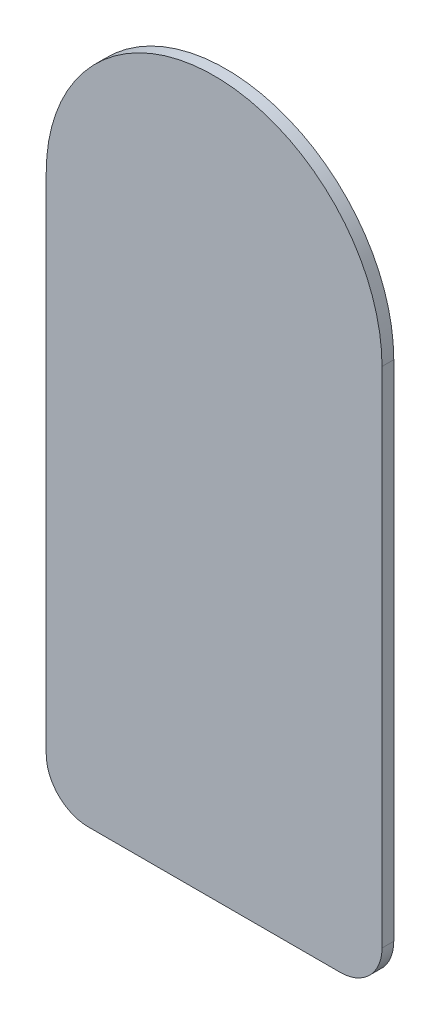
ISO-10303-21;
HEADER;
FILE_DESCRIPTION(('STEP AP214'),'2;1');
FILE_NAME('part.step','',(''),(''),'','','');
FILE_SCHEMA(('AUTOMOTIVE_DESIGN { 1 0 10303 214 1 1 1 1 }'));
ENDSEC;
DATA;
#1=APPLICATION_CONTEXT('core data for automotive mechanical design processes');
#2=APPLICATION_PROTOCOL_DEFINITION('international standard','automotive_design',2000,#1);
#3=PRODUCT_CONTEXT('',#1,'mechanical');
#4=PRODUCT('Part','Part','',(#3));
#5=PRODUCT_RELATED_PRODUCT_CATEGORY('part','',(#4));
#6=PRODUCT_DEFINITION_FORMATION('','',#4);
#7=PRODUCT_DEFINITION_CONTEXT('part definition',#1,'design');
#8=PRODUCT_DEFINITION('design','',#6,#7);
#9=PRODUCT_DEFINITION_SHAPE('','',#8);
#10=(LENGTH_UNIT() NAMED_UNIT(*) SI_UNIT(.MILLI.,.METRE.));
#11=(NAMED_UNIT(*) PLANE_ANGLE_UNIT() SI_UNIT($,.RADIAN.));
#12=(NAMED_UNIT(*) SI_UNIT($,.STERADIAN.) SOLID_ANGLE_UNIT());
#13=UNCERTAINTY_MEASURE_WITH_UNIT(LENGTH_MEASURE(1.E-05),#10,'distance_accuracy_value','');
#14=(GEOMETRIC_REPRESENTATION_CONTEXT(3) GLOBAL_UNCERTAINTY_ASSIGNED_CONTEXT((#13)) GLOBAL_UNIT_ASSIGNED_CONTEXT((#10,
#11,#12)) REPRESENTATION_CONTEXT('',''));
#15=CARTESIAN_POINT('',(0.,0.,0.));
#16=DIRECTION('',(0.,0.,1.));
#17=DIRECTION('',(1.,0.,0.));
#18=AXIS2_PLACEMENT_3D('',#15,#16,#17);
#19=CARTESIAN_POINT('',(0.,0.,0.7112));
#20=DIRECTION('',(0.,0.,-1.));
#21=DIRECTION('',(-1.,0.,0.));
#22=AXIS2_PLACEMENT_3D('',#19,#20,#21);
#23=CYLINDRICAL_SURFACE('',#22,10.16);
#24=CARTESIAN_POINT('',(0.,0.,0.));
#25=DIRECTION('',(0.,0.,1.));
#26=DIRECTION('',(1.,0.,0.));
#27=AXIS2_PLACEMENT_3D('',#24,#25,#26);
#28=CIRCLE('',#27,10.16);
#29=CARTESIAN_POINT('',(10.16,2.47198095326695E-13,0.));
#30=VERTEX_POINT('',#29);
#31=CARTESIAN_POINT('',(-10.16,-2.45463371850718E-13,0.));
#32=VERTEX_POINT('',#31);
#33=EDGE_CURVE('E117',#30,#32,#28,.T.);
#34=ORIENTED_EDGE('',*,*,#33,.T.);
#35=DIRECTION('',(0.,0.,-1.));
#36=VECTOR('',#35,1.);
#37=CARTESIAN_POINT('',(-10.16,-2.45463371850718E-13,0.7112));
#38=LINE('',#37,#36);
#39=CARTESIAN_POINT('',(-10.16,-2.45463371850718E-13,0.7112));
#40=VERTEX_POINT('',#39);
#41=EDGE_CURVE('E11',#40,#32,#38,.T.);
#42=ORIENTED_EDGE('',*,*,#41,.F.);
#43=CARTESIAN_POINT('',(0.,0.,0.7112));
#44=DIRECTION('',(0.,0.,1.));
#45=DIRECTION('',(1.,0.,0.));
#46=AXIS2_PLACEMENT_3D('',#43,#44,#45);
#47=CIRCLE('',#46,10.16);
#48=CARTESIAN_POINT('',(10.16,2.47198095326695E-13,0.7112));
#49=VERTEX_POINT('',#48);
#50=EDGE_CURVE('E127',#49,#40,#47,.T.);
#51=ORIENTED_EDGE('',*,*,#50,.F.);
#52=DIRECTION('',(0.,0.,-1.));
#53=VECTOR('',#52,1.);
#54=CARTESIAN_POINT('',(10.16,2.47198095326695E-13,0.7112));
#55=LINE('',#54,#53);
#56=EDGE_CURVE('E113',#49,#30,#55,.T.);
#57=ORIENTED_EDGE('',*,*,#56,.T.);
#58=EDGE_LOOP('',(#34,#42,#51,#57));
#59=FACE_BOUND('',#58,.T.);
#60=ADVANCED_FACE('F33',(#59),#23,.T.);
#61=CARTESIAN_POINT('',(-10.16,-2.45463371850718E-13,0.7112));
#62=DIRECTION('',(1.,0.,0.));
#63=DIRECTION('',(0.,1.,0.));
#64=AXIS2_PLACEMENT_3D('',#61,#62,#63);
#65=PLANE('',#64);
#66=DIRECTION('',(0.,-1.,0.));
#67=VECTOR('',#66,1.);
#68=CARTESIAN_POINT('',(-10.16,-2.45463371850718E-13,0.));
#69=LINE('',#68,#67);
#70=CARTESIAN_POINT('',(-10.1599999999993,-30.4800000000002,0.));
#71=VERTEX_POINT('',#70);
#72=EDGE_CURVE('E120',#32,#71,#69,.T.);
#73=ORIENTED_EDGE('',*,*,#72,.T.);
#74=DIRECTION('',(0.,0.,-1.));
#75=VECTOR('',#74,1.);
#76=CARTESIAN_POINT('',(-10.1599999999993,-30.4800000000002,0.7112));
#77=LINE('',#76,#75);
#78=CARTESIAN_POINT('',(-10.1599999999993,-30.4800000000002,0.7112));
#79=VERTEX_POINT('',#78);
#80=EDGE_CURVE('E41',#79,#71,#77,.T.);
#81=ORIENTED_EDGE('',*,*,#80,.F.);
#82=DIRECTION('',(0.,-1.,0.));
#83=VECTOR('',#82,1.);
#84=CARTESIAN_POINT('',(-10.16,-2.45463371850718E-13,0.7112));
#85=LINE('',#84,#83);
#86=EDGE_CURVE('E86',#40,#79,#85,.T.);
#87=ORIENTED_EDGE('',*,*,#86,.F.);
#88=ORIENTED_EDGE('',*,*,#41,.T.);
#89=EDGE_LOOP('',(#73,#81,#87,#88));
#90=FACE_BOUND('',#89,.T.);
#91=ADVANCED_FACE('F151',(#90),#65,.F.);
#92=CARTESIAN_POINT('',(-7.61999999999926,-30.4800000000002,0.7112));
#93=DIRECTION('',(0.,0.,-1.));
#94=DIRECTION('',(-1.,0.,0.));
#95=AXIS2_PLACEMENT_3D('',#92,#93,#94);
#96=CYLINDRICAL_SURFACE('',#95,2.54);
#97=CARTESIAN_POINT('',(-7.61999999999926,-30.4800000000002,0.));
#98=DIRECTION('',(0.,0.,1.));
#99=DIRECTION('',(1.,0.,0.));
#100=AXIS2_PLACEMENT_3D('',#97,#98,#99);
#101=CIRCLE('',#100,2.54);
#102=CARTESIAN_POINT('',(-7.61999999999918,-33.0200000000002,0.));
#103=VERTEX_POINT('',#102);
#104=EDGE_CURVE('E122',#71,#103,#101,.T.);
#105=ORIENTED_EDGE('',*,*,#104,.T.);
#106=DIRECTION('',(0.,0.,-1.));
#107=VECTOR('',#106,1.);
#108=CARTESIAN_POINT('',(-7.61999999999918,-33.0200000000002,0.7112));
#109=LINE('',#108,#107);
#110=CARTESIAN_POINT('',(-7.61999999999918,-33.0200000000002,0.7112));
#111=VERTEX_POINT('',#110);
#112=EDGE_CURVE('E108',#111,#103,#109,.T.);
#113=ORIENTED_EDGE('',*,*,#112,.F.);
#114=CARTESIAN_POINT('',(-7.61999999999926,-30.4800000000002,0.7112));
#115=DIRECTION('',(0.,0.,1.));
#116=DIRECTION('',(1.,0.,0.));
#117=AXIS2_PLACEMENT_3D('',#114,#115,#116);
#118=CIRCLE('',#117,2.54);
#119=EDGE_CURVE('E99',#79,#111,#118,.T.);
#120=ORIENTED_EDGE('',*,*,#119,.F.);
#121=ORIENTED_EDGE('',*,*,#80,.T.);
#122=EDGE_LOOP('',(#105,#113,#120,#121));
#123=FACE_BOUND('',#122,.T.);
#124=ADVANCED_FACE('F133',(#123),#96,.T.);
#125=CARTESIAN_POINT('',(-7.61999999999918,-33.0200000000002,0.7112));
#126=DIRECTION('',(0.,1.,0.));
#127=DIRECTION('',(-1.,0.,0.));
#128=AXIS2_PLACEMENT_3D('',#125,#126,#127);
#129=PLANE('',#128);
#130=DIRECTION('',(1.,0.,0.));
#131=VECTOR('',#130,1.);
#132=CARTESIAN_POINT('',(-7.61999999999918,-33.0200000000002,0.));
#133=LINE('',#132,#131);
#134=CARTESIAN_POINT('',(7.62000000000078,-33.0199999999998,0.));
#135=VERTEX_POINT('',#134);
#136=EDGE_CURVE('E107',#103,#135,#133,.T.);
#137=ORIENTED_EDGE('',*,*,#136,.T.);
#138=DIRECTION('',(0.,0.,-1.));
#139=VECTOR('',#138,1.);
#140=CARTESIAN_POINT('',(7.62000000000078,-33.0199999999998,0.7112));
#141=LINE('',#140,#139);
#142=CARTESIAN_POINT('',(7.62000000000078,-33.0199999999998,0.7112));
#143=VERTEX_POINT('',#142);
#144=EDGE_CURVE('E104',#143,#135,#141,.T.);
#145=ORIENTED_EDGE('',*,*,#144,.F.);
#146=DIRECTION('',(1.,0.,0.));
#147=VECTOR('',#146,1.);
#148=CARTESIAN_POINT('',(-7.61999999999918,-33.0200000000002,0.7112));
#149=LINE('',#148,#147);
#150=EDGE_CURVE('E93',#111,#143,#149,.T.);
#151=ORIENTED_EDGE('',*,*,#150,.F.);
#152=ORIENTED_EDGE('',*,*,#112,.T.);
#153=EDGE_LOOP('',(#137,#145,#151,#152));
#154=FACE_BOUND('',#153,.T.);
#155=ADVANCED_FACE('F105',(#154),#129,.F.);
#156=CARTESIAN_POINT('',(7.62000000000074,-30.4799999999998,0.7112));
#157=DIRECTION('',(0.,0.,-1.));
#158=DIRECTION('',(-1.,0.,0.));
#159=AXIS2_PLACEMENT_3D('',#156,#157,#158);
#160=CYLINDRICAL_SURFACE('',#159,2.54);
#161=CARTESIAN_POINT('',(7.62000000000074,-30.4799999999998,0.));
#162=DIRECTION('',(0.,0.,1.));
#163=DIRECTION('',(1.,0.,0.));
#164=AXIS2_PLACEMENT_3D('',#161,#162,#163);
#165=CIRCLE('',#164,2.54);
#166=CARTESIAN_POINT('',(10.1600000000007,-30.4799999999997,0.));
#167=VERTEX_POINT('',#166);
#168=EDGE_CURVE('E72',#135,#167,#165,.T.);
#169=ORIENTED_EDGE('',*,*,#168,.T.);
#170=DIRECTION('',(0.,0.,-1.));
#171=VECTOR('',#170,1.);
#172=CARTESIAN_POINT('',(10.1600000000007,-30.4799999999997,0.7112));
#173=LINE('',#172,#171);
#174=CARTESIAN_POINT('',(10.1600000000007,-30.4799999999997,0.7112));
#175=VERTEX_POINT('',#174);
#176=EDGE_CURVE('E109',#175,#167,#173,.T.);
#177=ORIENTED_EDGE('',*,*,#176,.F.);
#178=CARTESIAN_POINT('',(7.62000000000074,-30.4799999999998,0.7112));
#179=DIRECTION('',(0.,0.,1.));
#180=DIRECTION('',(1.,0.,0.));
#181=AXIS2_PLACEMENT_3D('',#178,#179,#180);
#182=CIRCLE('',#181,2.54);
#183=EDGE_CURVE('E97',#143,#175,#182,.T.);
#184=ORIENTED_EDGE('',*,*,#183,.F.);
#185=ORIENTED_EDGE('',*,*,#144,.T.);
#186=EDGE_LOOP('',(#169,#177,#184,#185));
#187=FACE_BOUND('',#186,.T.);
#188=ADVANCED_FACE('F111',(#187),#160,.T.);
#189=CARTESIAN_POINT('',(10.1600000000007,-30.4799999999997,0.7112));
#190=DIRECTION('',(-1.,0.,0.));
#191=DIRECTION('',(0.,-1.,0.));
#192=AXIS2_PLACEMENT_3D('',#189,#190,#191);
#193=PLANE('',#192);
#194=DIRECTION('',(0.,1.,0.));
#195=VECTOR('',#194,1.);
#196=CARTESIAN_POINT('',(10.1600000000007,-30.4799999999997,0.));
#197=LINE('',#196,#195);
#198=EDGE_CURVE('E78',#167,#30,#197,.T.);
#199=ORIENTED_EDGE('',*,*,#198,.T.);
#200=ORIENTED_EDGE('',*,*,#56,.F.);
#201=DIRECTION('',(0.,1.,0.));
#202=VECTOR('',#201,1.);
#203=CARTESIAN_POINT('',(10.1600000000007,-30.4799999999997,0.7112));
#204=LINE('',#203,#202);
#205=EDGE_CURVE('E49',#175,#49,#204,.T.);
#206=ORIENTED_EDGE('',*,*,#205,.F.);
#207=ORIENTED_EDGE('',*,*,#176,.T.);
#208=EDGE_LOOP('',(#199,#200,#206,#207));
#209=FACE_BOUND('',#208,.T.);
#210=ADVANCED_FACE('F140',(#209),#193,.F.);
#211=CARTESIAN_POINT('',(0.,0.,0.7112));
#212=DIRECTION('',(0.,0.,1.));
#213=DIRECTION('',(1.,0.,0.));
#214=AXIS2_PLACEMENT_3D('',#211,#212,#213);
#215=PLANE('',#214);
#216=ORIENTED_EDGE('',*,*,#50,.T.);
#217=ORIENTED_EDGE('',*,*,#86,.T.);
#218=ORIENTED_EDGE('',*,*,#119,.T.);
#219=ORIENTED_EDGE('',*,*,#150,.T.);
#220=ORIENTED_EDGE('',*,*,#183,.T.);
#221=ORIENTED_EDGE('',*,*,#205,.T.);
#222=EDGE_LOOP('',(#216,#217,#218,#219,#220,#221));
#223=FACE_BOUND('',#222,.T.);
#224=ADVANCED_FACE('F95',(#223),#215,.T.);
#225=CARTESIAN_POINT('',(0.,0.,0.));
#226=DIRECTION('',(0.,0.,1.));
#227=DIRECTION('',(1.,0.,0.));
#228=AXIS2_PLACEMENT_3D('',#225,#226,#227);
#229=PLANE('',#228);
#230=ORIENTED_EDGE('',*,*,#33,.F.);
#231=ORIENTED_EDGE('',*,*,#198,.F.);
#232=ORIENTED_EDGE('',*,*,#168,.F.);
#233=ORIENTED_EDGE('',*,*,#136,.F.);
#234=ORIENTED_EDGE('',*,*,#104,.F.);
#235=ORIENTED_EDGE('',*,*,#72,.F.);
#236=EDGE_LOOP('',(#230,#231,#232,#233,#234,#235));
#237=FACE_BOUND('',#236,.T.);
#238=ADVANCED_FACE('F136',(#237),#229,.F.);
#239=CLOSED_SHELL('',(#60,#91,#124,#155,#188,#210,#224,#238));
#240=MANIFOLD_SOLID_BREP('B2',#239);
#241=ADVANCED_BREP_SHAPE_REPRESENTATION('',(#18,#240),#14);
#242=SHAPE_DEFINITION_REPRESENTATION(#9,#241);
ENDSEC;
END-ISO-10303-21;
